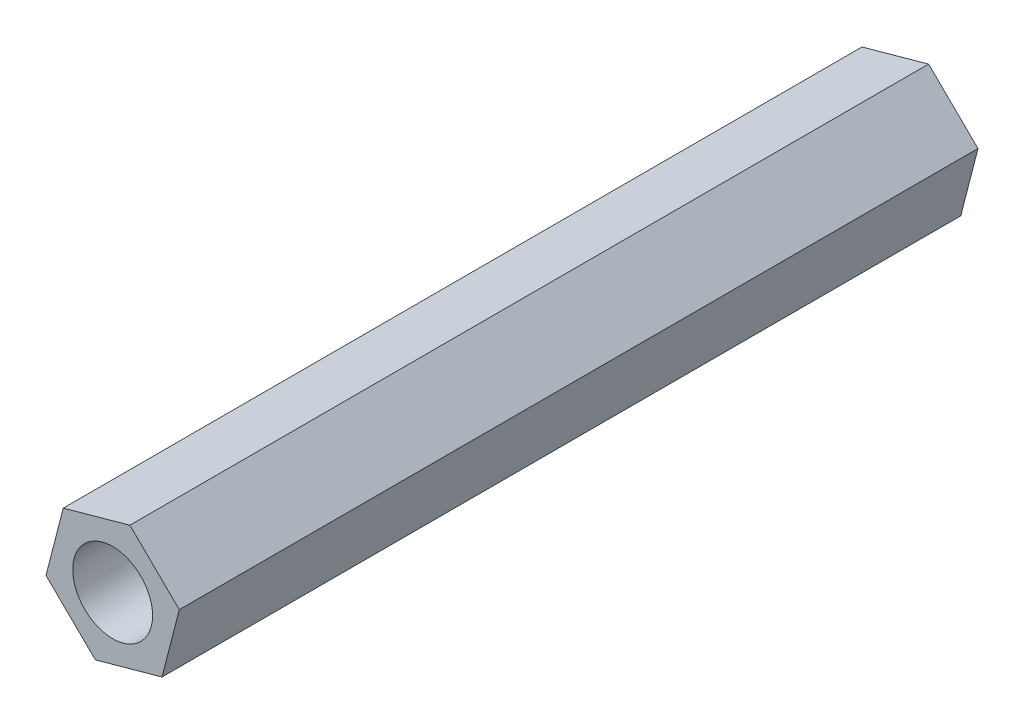
ISO-10303-21;
HEADER;
FILE_DESCRIPTION(('STEP AP214'),'2;1');
FILE_NAME('part.step','',(''),(''),'','','');
FILE_SCHEMA(('AUTOMOTIVE_DESIGN { 1 0 10303 214 1 1 1 1 }'));
ENDSEC;
DATA;
#1=APPLICATION_CONTEXT('core data for automotive mechanical design processes');
#2=APPLICATION_PROTOCOL_DEFINITION('international standard','automotive_design',2000,#1);
#3=PRODUCT_CONTEXT('',#1,'mechanical');
#4=PRODUCT('Part','Part','',(#3));
#5=PRODUCT_RELATED_PRODUCT_CATEGORY('part','',(#4));
#6=PRODUCT_DEFINITION_FORMATION('','',#4);
#7=PRODUCT_DEFINITION_CONTEXT('part definition',#1,'design');
#8=PRODUCT_DEFINITION('design','',#6,#7);
#9=PRODUCT_DEFINITION_SHAPE('','',#8);
#10=(LENGTH_UNIT() NAMED_UNIT(*) SI_UNIT(.MILLI.,.METRE.));
#11=(NAMED_UNIT(*) PLANE_ANGLE_UNIT() SI_UNIT($,.RADIAN.));
#12=(NAMED_UNIT(*) SI_UNIT($,.STERADIAN.) SOLID_ANGLE_UNIT());
#13=UNCERTAINTY_MEASURE_WITH_UNIT(LENGTH_MEASURE(1.E-05),#10,'distance_accuracy_value','');
#14=(GEOMETRIC_REPRESENTATION_CONTEXT(3) GLOBAL_UNCERTAINTY_ASSIGNED_CONTEXT((#13)) GLOBAL_UNIT_ASSIGNED_CONTEXT((#10,
#11,#12)) REPRESENTATION_CONTEXT('',''));
#15=CARTESIAN_POINT('',(0.,0.,0.));
#16=DIRECTION('',(0.,0.,1.));
#17=DIRECTION('',(1.,0.,0.));
#18=AXIS2_PLACEMENT_3D('',#15,#16,#17);
#19=CARTESIAN_POINT('',(-0.4326330238132,-1.67714896974188,20.));
#20=DIRECTION('',(-0.267834692669189,0.963464881250376,0.));
#21=DIRECTION('',(-0.963464881250376,-0.267834692669189,0.));
#22=AXIS2_PLACEMENT_3D('',#19,#20,#21);
#23=PLANE('',#22);
#24=DIRECTION('',(0.963464881250376,0.267834692669189,0.));
#25=VECTOR('',#24,1.);
#26=CARTESIAN_POINT('',(-0.4326330238132,-1.67714896974188,0.));
#27=LINE('',#26,#25);
#28=CARTESIAN_POINT('',(-0.4326330238132,-1.67714896974188,0.));
#29=VERTEX_POINT('',#28);
#30=CARTESIAN_POINT('',(1.23613710182077,-1.21324567400925,0.));
#31=VERTEX_POINT('',#30);
#32=EDGE_CURVE('E131',#29,#31,#27,.T.);
#33=ORIENTED_EDGE('',*,*,#32,.T.);
#34=DIRECTION('',(0.,0.,-1.));
#35=VECTOR('',#34,1.);
#36=CARTESIAN_POINT('',(1.23613710182077,-1.21324567400925,20.));
#37=LINE('',#36,#35);
#38=CARTESIAN_POINT('',(1.23613710182077,-1.21324567400925,20.));
#39=VERTEX_POINT('',#38);
#40=EDGE_CURVE('E11',#39,#31,#37,.T.);
#41=ORIENTED_EDGE('',*,*,#40,.F.);
#42=DIRECTION('',(0.963464881250376,0.267834692669189,0.));
#43=VECTOR('',#42,1.);
#44=CARTESIAN_POINT('',(-0.4326330238132,-1.67714896974188,20.));
#45=LINE('',#44,#43);
#46=CARTESIAN_POINT('',(-0.4326330238132,-1.67714896974188,20.));
#47=VERTEX_POINT('',#46);
#48=EDGE_CURVE('E141',#47,#39,#45,.T.);
#49=ORIENTED_EDGE('',*,*,#48,.F.);
#50=DIRECTION('',(0.,0.,-1.));
#51=VECTOR('',#50,1.);
#52=CARTESIAN_POINT('',(-0.4326330238132,-1.67714896974188,20.));
#53=LINE('',#52,#51);
#54=EDGE_CURVE('E118',#47,#29,#53,.T.);
#55=ORIENTED_EDGE('',*,*,#54,.T.);
#56=EDGE_LOOP('',(#33,#41,#49,#55));
#57=FACE_BOUND('',#56,.T.);
#58=ADVANCED_FACE('F37',(#57),#23,.F.);
#59=CARTESIAN_POINT('',(1.23613710182077,-1.21324567400925,20.));
#60=DIRECTION('',(-0.968302409151578,0.249780792758872,0.));
#61=DIRECTION('',(-0.249780792758872,-0.968302409151578,0.));
#62=AXIS2_PLACEMENT_3D('',#59,#60,#61);
#63=PLANE('',#62);
#64=DIRECTION('',(0.249780792758872,0.968302409151578,0.));
#65=VECTOR('',#64,1.);
#66=CARTESIAN_POINT('',(1.23613710182077,-1.21324567400925,0.));
#67=LINE('',#66,#65);
#68=CARTESIAN_POINT('',(1.66877012563397,0.463903295732631,0.));
#69=VERTEX_POINT('',#68);
#70=EDGE_CURVE('E127',#31,#69,#67,.T.);
#71=ORIENTED_EDGE('',*,*,#70,.T.);
#72=DIRECTION('',(0.,0.,-1.));
#73=VECTOR('',#72,1.);
#74=CARTESIAN_POINT('',(1.66877012563397,0.463903295732631,20.));
#75=LINE('',#74,#73);
#76=CARTESIAN_POINT('',(1.66877012563397,0.463903295732631,20.));
#77=VERTEX_POINT('',#76);
#78=EDGE_CURVE('E45',#77,#69,#75,.T.);
#79=ORIENTED_EDGE('',*,*,#78,.F.);
#80=DIRECTION('',(0.249780792758872,0.968302409151578,0.));
#81=VECTOR('',#80,1.);
#82=CARTESIAN_POINT('',(1.23613710182077,-1.21324567400925,20.));
#83=LINE('',#82,#81);
#84=EDGE_CURVE('E86',#39,#77,#83,.T.);
#85=ORIENTED_EDGE('',*,*,#84,.F.);
#86=ORIENTED_EDGE('',*,*,#40,.T.);
#87=EDGE_LOOP('',(#71,#79,#85,#86));
#88=FACE_BOUND('',#87,.T.);
#89=ADVANCED_FACE('F128',(#88),#63,.F.);
#90=CARTESIAN_POINT('',(1.66877012563397,0.463903295732631,20.));
#91=DIRECTION('',(-0.700467716482389,-0.713684088491503,0.));
#92=DIRECTION('',(0.713684088491503,-0.700467716482389,0.));
#93=AXIS2_PLACEMENT_3D('',#90,#91,#92);
#94=PLANE('',#93);
#95=DIRECTION('',(-0.713684088491503,0.700467716482389,0.));
#96=VECTOR('',#95,1.);
#97=CARTESIAN_POINT('',(1.66877012563397,0.463903295732631,0.));
#98=LINE('',#97,#96);
#99=CARTESIAN_POINT('',(0.4326330238132,1.67714896974188,0.));
#100=VERTEX_POINT('',#99);
#101=EDGE_CURVE('E126',#69,#100,#98,.T.);
#102=ORIENTED_EDGE('',*,*,#101,.T.);
#103=DIRECTION('',(0.,0.,-1.));
#104=VECTOR('',#103,1.);
#105=CARTESIAN_POINT('',(0.4326330238132,1.67714896974188,20.));
#106=LINE('',#105,#104);
#107=CARTESIAN_POINT('',(0.4326330238132,1.67714896974188,20.));
#108=VERTEX_POINT('',#107);
#109=EDGE_CURVE('E115',#108,#100,#106,.T.);
#110=ORIENTED_EDGE('',*,*,#109,.F.);
#111=DIRECTION('',(-0.713684088491503,0.700467716482389,0.));
#112=VECTOR('',#111,1.);
#113=CARTESIAN_POINT('',(1.66877012563397,0.463903295732631,20.));
#114=LINE('',#113,#112);
#115=EDGE_CURVE('E108',#77,#108,#114,.T.);
#116=ORIENTED_EDGE('',*,*,#115,.F.);
#117=ORIENTED_EDGE('',*,*,#78,.T.);
#118=EDGE_LOOP('',(#102,#110,#116,#117));
#119=FACE_BOUND('',#118,.T.);
#120=ADVANCED_FACE('F125',(#119),#94,.F.);
#121=CARTESIAN_POINT('',(0.4326330238132,1.67714896974188,20.));
#122=DIRECTION('',(0.267834692669189,-0.963464881250376,0.));
#123=DIRECTION('',(0.963464881250376,0.267834692669189,0.));
#124=AXIS2_PLACEMENT_3D('',#121,#122,#123);
#125=PLANE('',#124);
#126=DIRECTION('',(-0.963464881250376,-0.267834692669189,0.));
#127=VECTOR('',#126,1.);
#128=CARTESIAN_POINT('',(0.4326330238132,1.67714896974188,0.));
#129=LINE('',#128,#127);
#130=CARTESIAN_POINT('',(-1.23613710182077,1.21324567400925,0.));
#131=VERTEX_POINT('',#130);
#132=EDGE_CURVE('E114',#100,#131,#129,.T.);
#133=ORIENTED_EDGE('',*,*,#132,.T.);
#134=DIRECTION('',(0.,0.,-1.));
#135=VECTOR('',#134,1.);
#136=CARTESIAN_POINT('',(-1.23613710182077,1.21324567400925,20.));
#137=LINE('',#136,#135);
#138=CARTESIAN_POINT('',(-1.23613710182077,1.21324567400925,20.));
#139=VERTEX_POINT('',#138);
#140=EDGE_CURVE('E101',#139,#131,#137,.T.);
#141=ORIENTED_EDGE('',*,*,#140,.F.);
#142=DIRECTION('',(-0.963464881250376,-0.267834692669189,0.));
#143=VECTOR('',#142,1.);
#144=CARTESIAN_POINT('',(0.4326330238132,1.67714896974188,20.));
#145=LINE('',#144,#143);
#146=EDGE_CURVE('E104',#108,#139,#145,.T.);
#147=ORIENTED_EDGE('',*,*,#146,.F.);
#148=ORIENTED_EDGE('',*,*,#109,.T.);
#149=EDGE_LOOP('',(#133,#141,#147,#148));
#150=FACE_BOUND('',#149,.T.);
#151=ADVANCED_FACE('F113',(#150),#125,.F.);
#152=CARTESIAN_POINT('',(-1.23613710182077,1.21324567400925,20.));
#153=DIRECTION('',(0.968302409151578,-0.249780792758873,0.));
#154=DIRECTION('',(0.249780792758873,0.968302409151578,0.));
#155=AXIS2_PLACEMENT_3D('',#152,#153,#154);
#156=PLANE('',#155);
#157=DIRECTION('',(-0.249780792758873,-0.968302409151578,0.));
#158=VECTOR('',#157,1.);
#159=CARTESIAN_POINT('',(-1.23613710182077,1.21324567400925,0.));
#160=LINE('',#159,#158);
#161=CARTESIAN_POINT('',(-1.66877012563397,-0.463903295732631,0.));
#162=VERTEX_POINT('',#161);
#163=EDGE_CURVE('E139',#131,#162,#160,.T.);
#164=ORIENTED_EDGE('',*,*,#163,.T.);
#165=DIRECTION('',(0.,0.,-1.));
#166=VECTOR('',#165,1.);
#167=CARTESIAN_POINT('',(-1.66877012563397,-0.463903295732631,20.));
#168=LINE('',#167,#166);
#169=CARTESIAN_POINT('',(-1.66877012563397,-0.463903295732631,20.));
#170=VERTEX_POINT('',#169);
#171=EDGE_CURVE('E103',#170,#162,#168,.T.);
#172=ORIENTED_EDGE('',*,*,#171,.F.);
#173=DIRECTION('',(-0.249780792758873,-0.968302409151578,0.));
#174=VECTOR('',#173,1.);
#175=CARTESIAN_POINT('',(-1.23613710182077,1.21324567400925,20.));
#176=LINE('',#175,#174);
#177=EDGE_CURVE('E96',#139,#170,#176,.T.);
#178=ORIENTED_EDGE('',*,*,#177,.F.);
#179=ORIENTED_EDGE('',*,*,#140,.T.);
#180=EDGE_LOOP('',(#164,#172,#178,#179));
#181=FACE_BOUND('',#180,.T.);
#182=ADVANCED_FACE('F99',(#181),#156,.F.);
#183=CARTESIAN_POINT('',(-1.66877012563397,-0.463903295732631,20.));
#184=DIRECTION('',(0.700467716482389,0.713684088491503,0.));
#185=DIRECTION('',(-0.713684088491503,0.700467716482389,0.));
#186=AXIS2_PLACEMENT_3D('',#183,#184,#185);
#187=PLANE('',#186);
#188=DIRECTION('',(0.713684088491503,-0.700467716482389,0.));
#189=VECTOR('',#188,1.);
#190=CARTESIAN_POINT('',(-1.66877012563397,-0.463903295732631,0.));
#191=LINE('',#190,#189);
#192=EDGE_CURVE('E75',#162,#29,#191,.T.);
#193=ORIENTED_EDGE('',*,*,#192,.T.);
#194=ORIENTED_EDGE('',*,*,#54,.F.);
#195=DIRECTION('',(0.713684088491503,-0.700467716482389,0.));
#196=VECTOR('',#195,1.);
#197=CARTESIAN_POINT('',(-1.66877012563397,-0.463903295732631,20.));
#198=LINE('',#197,#196);
#199=EDGE_CURVE('E53',#170,#47,#198,.T.);
#200=ORIENTED_EDGE('',*,*,#199,.F.);
#201=ORIENTED_EDGE('',*,*,#171,.T.);
#202=EDGE_LOOP('',(#193,#194,#200,#201));
#203=FACE_BOUND('',#202,.T.);
#204=ADVANCED_FACE('F163',(#203),#187,.F.);
#205=CARTESIAN_POINT('',(0.,0.,20.));
#206=DIRECTION('',(0.,0.,1.));
#207=DIRECTION('',(1.,0.,0.));
#208=AXIS2_PLACEMENT_3D('',#205,#206,#207);
#209=PLANE('',#208);
#210=CARTESIAN_POINT('',(0.,0.,20.));
#211=DIRECTION('',(0.,0.,1.));
#212=DIRECTION('',(1.,0.,0.));
#213=AXIS2_PLACEMENT_3D('',#210,#211,#212);
#214=CIRCLE('',#213,1.);
#215=CARTESIAN_POINT('',(1.,0.,20.));
#216=VERTEX_POINT('',#215);
#217=EDGE_CURVE('E148',#216,#216,#214,.T.);
#218=ORIENTED_EDGE('',*,*,#217,.F.);
#219=EDGE_LOOP('',(#218));
#220=FACE_BOUND('',#219,.T.);
#221=ORIENTED_EDGE('',*,*,#48,.T.);
#222=ORIENTED_EDGE('',*,*,#84,.T.);
#223=ORIENTED_EDGE('',*,*,#115,.T.);
#224=ORIENTED_EDGE('',*,*,#146,.T.);
#225=ORIENTED_EDGE('',*,*,#177,.T.);
#226=ORIENTED_EDGE('',*,*,#199,.T.);
#227=EDGE_LOOP('',(#221,#222,#223,#224,#225,#226));
#228=FACE_BOUND('',#227,.T.);
#229=ADVANCED_FACE('F107',(#220,#228),#209,.T.);
#230=CARTESIAN_POINT('',(0.,0.,0.));
#231=DIRECTION('',(0.,0.,1.));
#232=DIRECTION('',(1.,0.,0.));
#233=AXIS2_PLACEMENT_3D('',#230,#231,#232);
#234=PLANE('',#233);
#235=CARTESIAN_POINT('',(0.,0.,0.));
#236=DIRECTION('',(0.,0.,1.));
#237=DIRECTION('',(1.,0.,0.));
#238=AXIS2_PLACEMENT_3D('',#235,#236,#237);
#239=CIRCLE('',#238,1.);
#240=CARTESIAN_POINT('',(1.,0.,0.));
#241=VERTEX_POINT('',#240);
#242=EDGE_CURVE('E134',#241,#241,#239,.T.);
#243=ORIENTED_EDGE('',*,*,#242,.T.);
#244=EDGE_LOOP('',(#243));
#245=FACE_BOUND('',#244,.T.);
#246=ORIENTED_EDGE('',*,*,#32,.F.);
#247=ORIENTED_EDGE('',*,*,#192,.F.);
#248=ORIENTED_EDGE('',*,*,#163,.F.);
#249=ORIENTED_EDGE('',*,*,#132,.F.);
#250=ORIENTED_EDGE('',*,*,#101,.F.);
#251=ORIENTED_EDGE('',*,*,#70,.F.);
#252=EDGE_LOOP('',(#246,#247,#248,#249,#250,#251));
#253=FACE_BOUND('',#252,.T.);
#254=ADVANCED_FACE('F154',(#245,#253),#234,.F.);
#255=CARTESIAN_POINT('',(0.,0.,0.));
#256=DIRECTION('',(0.,0.,1.));
#257=DIRECTION('',(1.,0.,0.));
#258=AXIS2_PLACEMENT_3D('',#255,#256,#257);
#259=CYLINDRICAL_SURFACE('',#258,1.);
#260=ORIENTED_EDGE('',*,*,#242,.F.);
#261=EDGE_LOOP('',(#260));
#262=FACE_BOUND('',#261,.T.);
#263=ORIENTED_EDGE('',*,*,#217,.T.);
#264=EDGE_LOOP('',(#263));
#265=FACE_BOUND('',#264,.T.);
#266=ADVANCED_FACE('F156',(#262,#265),#259,.F.);
#267=CLOSED_SHELL('',(#58,#89,#120,#151,#182,#204,#229,#254,#266));
#268=MANIFOLD_SOLID_BREP('B2',#267);
#269=ADVANCED_BREP_SHAPE_REPRESENTATION('',(#18,#268),#14);
#270=SHAPE_DEFINITION_REPRESENTATION(#9,#269);
ENDSEC;
END-ISO-10303-21;
